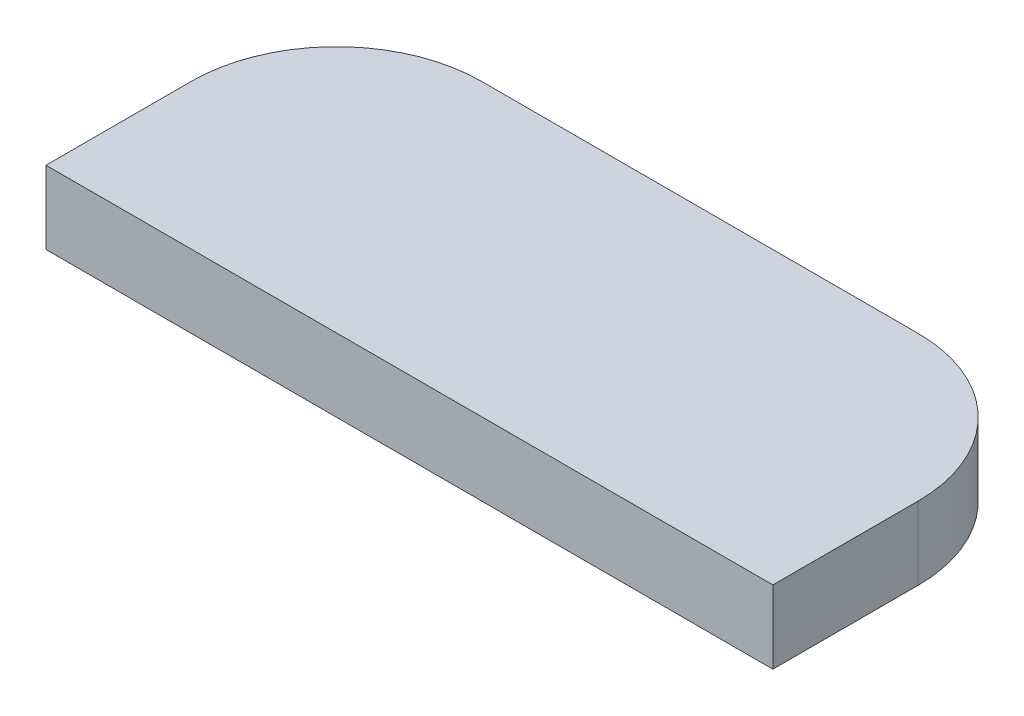
ISO-10303-21;
HEADER;
FILE_DESCRIPTION(('STEP AP214'),'2;1');
FILE_NAME('part.step','',(''),(''),'','','');
FILE_SCHEMA(('AUTOMOTIVE_DESIGN { 1 0 10303 214 1 1 1 1 }'));
ENDSEC;
DATA;
#1=APPLICATION_CONTEXT('core data for automotive mechanical design processes');
#2=APPLICATION_PROTOCOL_DEFINITION('international standard','automotive_design',2000,#1);
#3=PRODUCT_CONTEXT('',#1,'mechanical');
#4=PRODUCT('Part','Part','',(#3));
#5=PRODUCT_RELATED_PRODUCT_CATEGORY('part','',(#4));
#6=PRODUCT_DEFINITION_FORMATION('','',#4);
#7=PRODUCT_DEFINITION_CONTEXT('part definition',#1,'design');
#8=PRODUCT_DEFINITION('design','',#6,#7);
#9=PRODUCT_DEFINITION_SHAPE('','',#8);
#10=(LENGTH_UNIT() NAMED_UNIT(*) SI_UNIT(.MILLI.,.METRE.));
#11=(NAMED_UNIT(*) PLANE_ANGLE_UNIT() SI_UNIT($,.RADIAN.));
#12=(NAMED_UNIT(*) SI_UNIT($,.STERADIAN.) SOLID_ANGLE_UNIT());
#13=UNCERTAINTY_MEASURE_WITH_UNIT(LENGTH_MEASURE(1.E-05),#10,'distance_accuracy_value','');
#14=(GEOMETRIC_REPRESENTATION_CONTEXT(3) GLOBAL_UNCERTAINTY_ASSIGNED_CONTEXT((#13)) GLOBAL_UNIT_ASSIGNED_CONTEXT((#10,
#11,#12)) REPRESENTATION_CONTEXT('',''));
#15=CARTESIAN_POINT('',(0.,0.,0.));
#16=DIRECTION('',(0.,0.,1.));
#17=DIRECTION('',(1.,0.,0.));
#18=AXIS2_PLACEMENT_3D('',#15,#16,#17);
#19=CARTESIAN_POINT('',(-55.626,11.176,0.));
#20=DIRECTION('',(-1.,0.,0.));
#21=DIRECTION('',(0.,0.,1.));
#22=AXIS2_PLACEMENT_3D('',#19,#20,#21);
#23=PLANE('',#22);
#24=DIRECTION('',(0.,0.,-1.));
#25=VECTOR('',#24,1.);
#26=CARTESIAN_POINT('',(-55.626,0.,0.));
#27=LINE('',#26,#25);
#28=CARTESIAN_POINT('',(-55.626,0.,0.));
#29=VERTEX_POINT('',#28);
#30=CARTESIAN_POINT('',(-55.626,0.,-22.2249999999998));
#31=VERTEX_POINT('',#30);
#32=EDGE_CURVE('E122',#29,#31,#27,.T.);
#33=ORIENTED_EDGE('',*,*,#32,.F.);
#34=DIRECTION('',(0.,-1.,0.));
#35=VECTOR('',#34,1.);
#36=CARTESIAN_POINT('',(-55.626,11.176,0.));
#37=LINE('',#36,#35);
#38=CARTESIAN_POINT('',(-55.626,11.176,0.));
#39=VERTEX_POINT('',#38);
#40=EDGE_CURVE('E11',#39,#29,#37,.T.);
#41=ORIENTED_EDGE('',*,*,#40,.F.);
#42=DIRECTION('',(0.,0.,-1.));
#43=VECTOR('',#42,1.);
#44=CARTESIAN_POINT('',(-55.626,11.176,0.));
#45=LINE('',#44,#43);
#46=CARTESIAN_POINT('',(-55.626,11.176,-22.2249999999998));
#47=VERTEX_POINT('',#46);
#48=EDGE_CURVE('E136',#39,#47,#45,.T.);
#49=ORIENTED_EDGE('',*,*,#48,.T.);
#50=DIRECTION('',(0.,-1.,0.));
#51=VECTOR('',#50,1.);
#52=CARTESIAN_POINT('',(-55.626,11.176,-22.2249999999998));
#53=LINE('',#52,#51);
#54=EDGE_CURVE('E40',#47,#31,#53,.T.);
#55=ORIENTED_EDGE('',*,*,#54,.T.);
#56=EDGE_LOOP('',(#33,#41,#49,#55));
#57=FACE_BOUND('',#56,.T.);
#58=ADVANCED_FACE('F37',(#57),#23,.T.);
#59=CARTESIAN_POINT('',(55.626,11.176,0.));
#60=DIRECTION('',(0.,0.,1.));
#61=DIRECTION('',(1.,0.,0.));
#62=AXIS2_PLACEMENT_3D('',#59,#60,#61);
#63=PLANE('',#62);
#64=DIRECTION('',(-1.,0.,0.));
#65=VECTOR('',#64,1.);
#66=CARTESIAN_POINT('',(55.626,0.,0.));
#67=LINE('',#66,#65);
#68=CARTESIAN_POINT('',(55.626,0.,0.));
#69=VERTEX_POINT('',#68);
#70=EDGE_CURVE('E134',#69,#29,#67,.T.);
#71=ORIENTED_EDGE('',*,*,#70,.F.);
#72=DIRECTION('',(0.,-1.,0.));
#73=VECTOR('',#72,1.);
#74=CARTESIAN_POINT('',(55.626,11.176,0.));
#75=LINE('',#74,#73);
#76=CARTESIAN_POINT('',(55.626,11.176,0.));
#77=VERTEX_POINT('',#76);
#78=EDGE_CURVE('E46',#77,#69,#75,.T.);
#79=ORIENTED_EDGE('',*,*,#78,.F.);
#80=DIRECTION('',(-1.,0.,0.));
#81=VECTOR('',#80,1.);
#82=CARTESIAN_POINT('',(55.626,11.176,0.));
#83=LINE('',#82,#81);
#84=EDGE_CURVE('E102',#77,#39,#83,.T.);
#85=ORIENTED_EDGE('',*,*,#84,.T.);
#86=ORIENTED_EDGE('',*,*,#40,.T.);
#87=EDGE_LOOP('',(#71,#79,#85,#86));
#88=FACE_BOUND('',#87,.T.);
#89=ADVANCED_FACE('F144',(#88),#63,.T.);
#90=CARTESIAN_POINT('',(55.626,11.176,0.));
#91=DIRECTION('',(-1.,0.,0.));
#92=DIRECTION('',(0.,0.,1.));
#93=AXIS2_PLACEMENT_3D('',#90,#91,#92);
#94=PLANE('',#93);
#95=DIRECTION('',(0.,0.,-1.));
#96=VECTOR('',#95,1.);
#97=CARTESIAN_POINT('',(55.626,0.,0.));
#98=LINE('',#97,#96);
#99=CARTESIAN_POINT('',(55.626,0.,-22.2249999999998));
#100=VERTEX_POINT('',#99);
#101=EDGE_CURVE('E107',#69,#100,#98,.T.);
#102=ORIENTED_EDGE('',*,*,#101,.T.);
#103=DIRECTION('',(0.,-1.,0.));
#104=VECTOR('',#103,1.);
#105=CARTESIAN_POINT('',(55.626,11.176,-22.2249999999998));
#106=LINE('',#105,#104);
#107=CARTESIAN_POINT('',(55.626,11.176,-22.2249999999998));
#108=VERTEX_POINT('',#107);
#109=EDGE_CURVE('E105',#108,#100,#106,.T.);
#110=ORIENTED_EDGE('',*,*,#109,.F.);
#111=DIRECTION('',(0.,0.,-1.));
#112=VECTOR('',#111,1.);
#113=CARTESIAN_POINT('',(55.626,11.176,0.));
#114=LINE('',#113,#112);
#115=EDGE_CURVE('E95',#77,#108,#114,.T.);
#116=ORIENTED_EDGE('',*,*,#115,.F.);
#117=ORIENTED_EDGE('',*,*,#78,.T.);
#118=EDGE_LOOP('',(#102,#110,#116,#117));
#119=FACE_BOUND('',#118,.T.);
#120=ADVANCED_FACE('F106',(#119),#94,.F.);
#121=CARTESIAN_POINT('',(33.401,11.176,-22.225));
#122=DIRECTION('',(0.,-1.,0.));
#123=DIRECTION('',(0.,0.,-1.));
#124=AXIS2_PLACEMENT_3D('',#121,#122,#123);
#125=CYLINDRICAL_SURFACE('',#124,22.225);
#126=CARTESIAN_POINT('',(33.401,0.,-22.225));
#127=DIRECTION('',(0.,1.,0.));
#128=DIRECTION('',(0.,0.,1.));
#129=AXIS2_PLACEMENT_3D('',#126,#127,#128);
#130=CIRCLE('',#129,22.225);
#131=CARTESIAN_POINT('',(33.4009999999998,0.,-44.45));
#132=VERTEX_POINT('',#131);
#133=EDGE_CURVE('E131',#100,#132,#130,.T.);
#134=ORIENTED_EDGE('',*,*,#133,.T.);
#135=DIRECTION('',(0.,-1.,0.));
#136=VECTOR('',#135,1.);
#137=CARTESIAN_POINT('',(33.4009999999998,11.176,-44.45));
#138=LINE('',#137,#136);
#139=CARTESIAN_POINT('',(33.4009999999998,11.176,-44.45));
#140=VERTEX_POINT('',#139);
#141=EDGE_CURVE('E111',#140,#132,#138,.T.);
#142=ORIENTED_EDGE('',*,*,#141,.F.);
#143=CARTESIAN_POINT('',(33.401,11.176,-22.225));
#144=DIRECTION('',(0.,1.,0.));
#145=DIRECTION('',(0.,0.,1.));
#146=AXIS2_PLACEMENT_3D('',#143,#144,#145);
#147=CIRCLE('',#146,22.225);
#148=EDGE_CURVE('E100',#108,#140,#147,.T.);
#149=ORIENTED_EDGE('',*,*,#148,.F.);
#150=ORIENTED_EDGE('',*,*,#109,.T.);
#151=EDGE_LOOP('',(#134,#142,#149,#150));
#152=FACE_BOUND('',#151,.T.);
#153=ADVANCED_FACE('F113',(#152),#125,.T.);
#154=CARTESIAN_POINT('',(-33.4009999999998,11.176,-44.45));
#155=DIRECTION('',(0.,0.,-1.));
#156=DIRECTION('',(-1.,0.,0.));
#157=AXIS2_PLACEMENT_3D('',#154,#155,#156);
#158=PLANE('',#157);
#159=DIRECTION('',(1.,0.,0.));
#160=VECTOR('',#159,1.);
#161=CARTESIAN_POINT('',(-33.4009999999998,0.,-44.45));
#162=LINE('',#161,#160);
#163=CARTESIAN_POINT('',(-33.401,0.,-44.45));
#164=VERTEX_POINT('',#163);
#165=EDGE_CURVE('E128',#164,#132,#162,.T.);
#166=ORIENTED_EDGE('',*,*,#165,.F.);
#167=DIRECTION('',(0.,-1.,0.));
#168=VECTOR('',#167,1.);
#169=CARTESIAN_POINT('',(-33.401,11.176,-44.45));
#170=LINE('',#169,#168);
#171=CARTESIAN_POINT('',(-33.401,11.176,-44.45));
#172=VERTEX_POINT('',#171);
#173=EDGE_CURVE('E139',#172,#164,#170,.T.);
#174=ORIENTED_EDGE('',*,*,#173,.F.);
#175=DIRECTION('',(1.,0.,0.));
#176=VECTOR('',#175,1.);
#177=CARTESIAN_POINT('',(-33.4009999999998,11.176,-44.45));
#178=LINE('',#177,#176);
#179=EDGE_CURVE('E115',#172,#140,#178,.T.);
#180=ORIENTED_EDGE('',*,*,#179,.T.);
#181=ORIENTED_EDGE('',*,*,#141,.T.);
#182=EDGE_LOOP('',(#166,#174,#180,#181));
#183=FACE_BOUND('',#182,.T.);
#184=ADVANCED_FACE('F157',(#183),#158,.T.);
#185=CARTESIAN_POINT('',(-33.401,11.176,-22.225));
#186=DIRECTION('',(0.,-1.,0.));
#187=DIRECTION('',(0.,0.,-1.));
#188=AXIS2_PLACEMENT_3D('',#185,#186,#187);
#189=CYLINDRICAL_SURFACE('',#188,22.225);
#190=CARTESIAN_POINT('',(-33.401,0.,-22.225));
#191=DIRECTION('',(0.,-1.,0.));
#192=DIRECTION('',(0.,0.,-1.));
#193=AXIS2_PLACEMENT_3D('',#190,#191,#192);
#194=CIRCLE('',#193,22.225);
#195=EDGE_CURVE('E125',#31,#164,#194,.T.);
#196=ORIENTED_EDGE('',*,*,#195,.F.);
#197=ORIENTED_EDGE('',*,*,#54,.F.);
#198=CARTESIAN_POINT('',(-33.401,11.176,-22.225));
#199=DIRECTION('',(0.,-1.,0.));
#200=DIRECTION('',(0.,0.,-1.));
#201=AXIS2_PLACEMENT_3D('',#198,#199,#200);
#202=CIRCLE('',#201,22.225);
#203=EDGE_CURVE('E117',#47,#172,#202,.T.);
#204=ORIENTED_EDGE('',*,*,#203,.T.);
#205=ORIENTED_EDGE('',*,*,#173,.T.);
#206=EDGE_LOOP('',(#196,#197,#204,#205));
#207=FACE_BOUND('',#206,.T.);
#208=ADVANCED_FACE('F141',(#207),#189,.T.);
#209=CARTESIAN_POINT('',(-33.401,11.176,-22.225));
#210=DIRECTION('',(0.,-1.,0.));
#211=DIRECTION('',(0.,0.,-1.));
#212=AXIS2_PLACEMENT_3D('',#209,#210,#211);
#213=PLANE('',#212);
#214=ORIENTED_EDGE('',*,*,#48,.F.);
#215=ORIENTED_EDGE('',*,*,#84,.F.);
#216=ORIENTED_EDGE('',*,*,#115,.T.);
#217=ORIENTED_EDGE('',*,*,#148,.T.);
#218=ORIENTED_EDGE('',*,*,#179,.F.);
#219=ORIENTED_EDGE('',*,*,#203,.F.);
#220=EDGE_LOOP('',(#214,#215,#216,#217,#218,#219));
#221=FACE_BOUND('',#220,.T.);
#222=ADVANCED_FACE('F97',(#221),#213,.F.);
#223=CARTESIAN_POINT('',(-33.401,0.,-22.225));
#224=DIRECTION('',(0.,-1.,0.));
#225=DIRECTION('',(0.,0.,-1.));
#226=AXIS2_PLACEMENT_3D('',#223,#224,#225);
#227=PLANE('',#226);
#228=ORIENTED_EDGE('',*,*,#32,.T.);
#229=ORIENTED_EDGE('',*,*,#195,.T.);
#230=ORIENTED_EDGE('',*,*,#165,.T.);
#231=ORIENTED_EDGE('',*,*,#133,.F.);
#232=ORIENTED_EDGE('',*,*,#101,.F.);
#233=ORIENTED_EDGE('',*,*,#70,.T.);
#234=EDGE_LOOP('',(#228,#229,#230,#231,#232,#233));
#235=FACE_BOUND('',#234,.T.);
#236=ADVANCED_FACE('F143',(#235),#227,.T.);
#237=CLOSED_SHELL('',(#58,#89,#120,#153,#184,#208,#222,#236));
#238=MANIFOLD_SOLID_BREP('B2',#237);
#239=ADVANCED_BREP_SHAPE_REPRESENTATION('',(#18,#238),#14);
#240=SHAPE_DEFINITION_REPRESENTATION(#9,#239);
ENDSEC;
END-ISO-10303-21;
